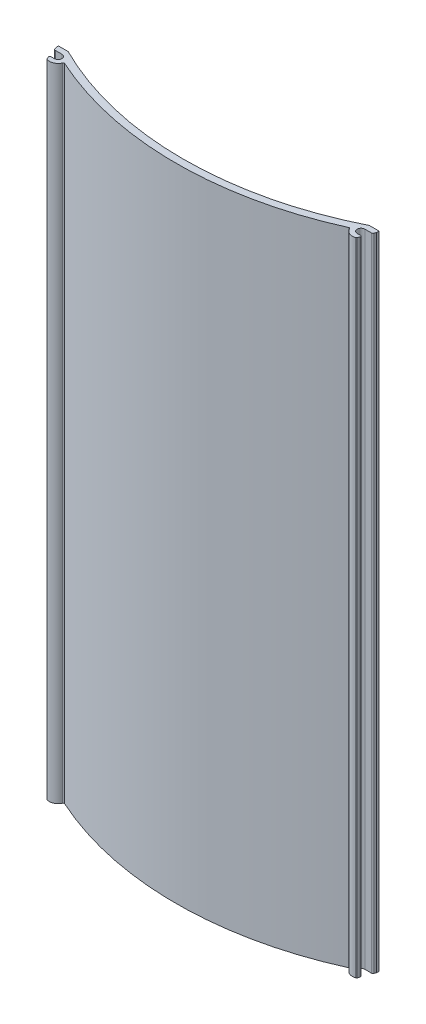
ISO-10303-21;
HEADER;
FILE_DESCRIPTION(('STEP AP214'),'2;1');
FILE_NAME('part.step','',(''),(''),'','','');
FILE_SCHEMA(('AUTOMOTIVE_DESIGN { 1 0 10303 214 1 1 1 1 }'));
ENDSEC;
DATA;
#1=APPLICATION_CONTEXT('core data for automotive mechanical design processes');
#2=APPLICATION_PROTOCOL_DEFINITION('international standard','automotive_design',2000,#1);
#3=PRODUCT_CONTEXT('',#1,'mechanical');
#4=PRODUCT('Part','Part','',(#3));
#5=PRODUCT_RELATED_PRODUCT_CATEGORY('part','',(#4));
#6=PRODUCT_DEFINITION_FORMATION('','',#4);
#7=PRODUCT_DEFINITION_CONTEXT('part definition',#1,'design');
#8=PRODUCT_DEFINITION('design','',#6,#7);
#9=PRODUCT_DEFINITION_SHAPE('','',#8);
#10=(LENGTH_UNIT() NAMED_UNIT(*) SI_UNIT(.MILLI.,.METRE.));
#11=(NAMED_UNIT(*) PLANE_ANGLE_UNIT() SI_UNIT($,.RADIAN.));
#12=(NAMED_UNIT(*) SI_UNIT($,.STERADIAN.) SOLID_ANGLE_UNIT());
#13=UNCERTAINTY_MEASURE_WITH_UNIT(LENGTH_MEASURE(1.E-05),#10,'distance_accuracy_value','');
#14=(GEOMETRIC_REPRESENTATION_CONTEXT(3) GLOBAL_UNCERTAINTY_ASSIGNED_CONTEXT((#13)) GLOBAL_UNIT_ASSIGNED_CONTEXT((#10,
#11,#12)) REPRESENTATION_CONTEXT('',''));
#15=CARTESIAN_POINT('',(0.,0.,0.));
#16=DIRECTION('',(0.,0.,1.));
#17=DIRECTION('',(1.,0.,0.));
#18=AXIS2_PLACEMENT_3D('',#15,#16,#17);
#19=CARTESIAN_POINT('',(101.58476,203.2,0.));
#20=DIRECTION('',(1.,0.,0.));
#21=DIRECTION('',(0.,0.,-1.));
#22=AXIS2_PLACEMENT_3D('',#19,#20,#21);
#23=PLANE('',#22);
#24=DIRECTION('',(0.,1.,0.));
#25=VECTOR('',#24,1.);
#26=CARTESIAN_POINT('',(101.58476,0.,-5.59206360851805));
#27=LINE('',#26,#25);
#28=CARTESIAN_POINT('',(101.58476,0.,-5.59206360851805));
#29=VERTEX_POINT('',#28);
#30=CARTESIAN_POINT('',(101.58476,203.2,-5.59206360851805));
#31=VERTEX_POINT('',#30);
#32=EDGE_CURVE('E351',#29,#31,#27,.T.);
#33=ORIENTED_EDGE('',*,*,#32,.F.);
#34=DIRECTION('',(0.,0.,1.));
#35=VECTOR('',#34,1.);
#36=CARTESIAN_POINT('',(101.58476,0.,0.));
#37=LINE('',#36,#35);
#38=CARTESIAN_POINT('',(101.58476,0.,-6.35406360851805));
#39=VERTEX_POINT('',#38);
#40=EDGE_CURVE('E354',#39,#29,#37,.T.);
#41=ORIENTED_EDGE('',*,*,#40,.F.);
#42=DIRECTION('',(0.,-1.,0.));
#43=VECTOR('',#42,1.);
#44=CARTESIAN_POINT('',(101.58476,203.2,-6.35406360851805));
#45=LINE('',#44,#43);
#46=CARTESIAN_POINT('',(101.58476,203.2,-6.35406360851805));
#47=VERTEX_POINT('',#46);
#48=EDGE_CURVE('E230',#47,#39,#45,.T.);
#49=ORIENTED_EDGE('',*,*,#48,.F.);
#50=DIRECTION('',(0.,0.,1.));
#51=VECTOR('',#50,1.);
#52=CARTESIAN_POINT('',(101.58476,203.2,0.));
#53=LINE('',#52,#51);
#54=EDGE_CURVE('E359',#47,#31,#53,.T.);
#55=ORIENTED_EDGE('',*,*,#54,.T.);
#56=EDGE_LOOP('',(#33,#41,#49,#55));
#57=FACE_BOUND('',#56,.T.);
#58=ADVANCED_FACE('F37',(#57),#23,.T.);
#59=CARTESIAN_POINT('',(0.,203.2,0.));
#60=DIRECTION('',(-1.,0.,0.));
#61=DIRECTION('',(0.,0.,1.));
#62=AXIS2_PLACEMENT_3D('',#59,#60,#61);
#63=PLANE('',#62);
#64=DIRECTION('',(0.,1.,0.));
#65=VECTOR('',#64,1.);
#66=CARTESIAN_POINT('',(0.,0.,-5.59206360851805));
#67=LINE('',#66,#65);
#68=CARTESIAN_POINT('',(0.,0.,-5.59206360851805));
#69=VERTEX_POINT('',#68);
#70=CARTESIAN_POINT('',(0.,203.2,-5.59206360851805));
#71=VERTEX_POINT('',#70);
#72=EDGE_CURVE('E355',#69,#71,#67,.T.);
#73=ORIENTED_EDGE('',*,*,#72,.T.);
#74=DIRECTION('',(0.,0.,-1.));
#75=VECTOR('',#74,1.);
#76=CARTESIAN_POINT('',(0.,203.2,0.));
#77=LINE('',#76,#75);
#78=CARTESIAN_POINT('',(0.,203.2,-6.35406360851805));
#79=VERTEX_POINT('',#78);
#80=EDGE_CURVE('E362',#71,#79,#77,.T.);
#81=ORIENTED_EDGE('',*,*,#80,.T.);
#82=DIRECTION('',(0.,-1.,0.));
#83=VECTOR('',#82,1.);
#84=CARTESIAN_POINT('',(0.,203.2,-6.35406360851805));
#85=LINE('',#84,#83);
#86=CARTESIAN_POINT('',(0.,0.,-6.35406360851805));
#87=VERTEX_POINT('',#86);
#88=EDGE_CURVE('E366',#79,#87,#85,.T.);
#89=ORIENTED_EDGE('',*,*,#88,.T.);
#90=DIRECTION('',(0.,0.,-1.));
#91=VECTOR('',#90,1.);
#92=CARTESIAN_POINT('',(0.,0.,0.));
#93=LINE('',#92,#91);
#94=EDGE_CURVE('E363',#69,#87,#93,.T.);
#95=ORIENTED_EDGE('',*,*,#94,.F.);
#96=EDGE_LOOP('',(#73,#81,#89,#95));
#97=FACE_BOUND('',#96,.T.);
#98=ADVANCED_FACE('F469',(#97),#63,.T.);
#99=CARTESIAN_POINT('',(0.,203.2,0.));
#100=DIRECTION('',(0.,1.,0.));
#101=DIRECTION('',(0.,0.,1.));
#102=AXIS2_PLACEMENT_3D('',#99,#100,#101);
#103=PLANE('',#102);
#104=CARTESIAN_POINT('',(50.79238,203.2,-101.753015943108));
#105=DIRECTION('',(0.,1.,0.));
#106=DIRECTION('',(0.,0.,1.));
#107=AXIS2_PLACEMENT_3D('',#104,#105,#106);
#108=CIRCLE('',#107,106.68);
#109=CARTESIAN_POINT('',(3.04657082827661,203.2,-6.35406360851807));
#110=VERTEX_POINT('',#109);
#111=CARTESIAN_POINT('',(98.5381891717234,203.2,-6.35406360851808));
#112=VERTEX_POINT('',#111);
#113=EDGE_CURVE('E234',#110,#112,#108,.T.);
#114=ORIENTED_EDGE('',*,*,#113,.F.);
#115=DIRECTION('',(-1.,0.,0.));
#116=VECTOR('',#115,1.);
#117=CARTESIAN_POINT('',(0.,203.2,-6.35406360851803));
#118=LINE('',#117,#116);
#119=EDGE_CURVE('E231',#110,#79,#118,.T.);
#120=ORIENTED_EDGE('',*,*,#119,.T.);
#121=ORIENTED_EDGE('',*,*,#80,.F.);
#122=DIRECTION('',(-0.342020143325663,0.,-0.939692620785911));
#123=VECTOR('',#122,1.);
#124=CARTESIAN_POINT('',(0.,203.2,-5.59206360851805));
#125=LINE('',#124,#123);
#126=CARTESIAN_POINT('',(0.225023227207039,203.2,-4.97381737291389));
#127=VERTEX_POINT('',#126);
#128=EDGE_CURVE('E315',#127,#71,#125,.T.);
#129=ORIENTED_EDGE('',*,*,#128,.F.);
#130=CARTESIAN_POINT('',(0.702387078566281,203.2,-5.14756360572333));
#131=DIRECTION('',(0.,1.,0.));
#132=DIRECTION('',(0.,0.,1.));
#133=AXIS2_PLACEMENT_3D('',#130,#131,#132);
#134=CIRCLE('',#133,0.508);
#135=CARTESIAN_POINT('',(0.702387078566281,203.2,-4.63956360572333));
#136=VERTEX_POINT('',#135);
#137=EDGE_CURVE('E379',#127,#136,#134,.T.);
#138=ORIENTED_EDGE('',*,*,#137,.T.);
#139=DIRECTION('',(1.,0.,0.));
#140=VECTOR('',#139,1.);
#141=CARTESIAN_POINT('',(0.,203.2,-4.63956360572333));
#142=LINE('',#141,#140);
#143=CARTESIAN_POINT('',(2.79400000000006,203.2,-4.63956360572333));
#144=VERTEX_POINT('',#143);
#145=EDGE_CURVE('E279',#136,#144,#142,.T.);
#146=ORIENTED_EDGE('',*,*,#145,.T.);
#147=CARTESIAN_POINT('',(2.79400000000006,203.2,-3.43306360572333));
#148=DIRECTION('',(0.,1.,0.));
#149=DIRECTION('',(0.,0.,1.));
#150=AXIS2_PLACEMENT_3D('',#147,#148,#149);
#151=CIRCLE('',#150,1.2065);
#152=CARTESIAN_POINT('',(2.79400000000006,203.2,-2.22656360572333));
#153=VERTEX_POINT('',#152);
#154=EDGE_CURVE('E221',#153,#144,#151,.T.);
#155=ORIENTED_EDGE('',*,*,#154,.F.);
#156=DIRECTION('',(-1.,0.,0.));
#157=VECTOR('',#156,1.);
#158=CARTESIAN_POINT('',(0.,203.2,-2.22656360572333));
#159=LINE('',#158,#157);
#160=CARTESIAN_POINT('',(1.76906621500891,203.2,-2.22656360572333));
#161=VERTEX_POINT('',#160);
#162=EDGE_CURVE('E264',#153,#161,#159,.T.);
#163=ORIENTED_EDGE('',*,*,#162,.T.);
#164=CARTESIAN_POINT('',(1.76906621500891,203.2,-1.84556360572333));
#165=DIRECTION('',(0.,1.,0.));
#166=DIRECTION('',(0.,0.,1.));
#167=AXIS2_PLACEMENT_3D('',#164,#165,#166);
#168=CIRCLE('',#167,0.380999999999997);
#169=CARTESIAN_POINT('',(1.41104332648949,203.2,-1.71525393111625));
#170=VERTEX_POINT('',#169);
#171=EDGE_CURVE('E267',#161,#170,#168,.T.);
#172=ORIENTED_EDGE('',*,*,#171,.T.);
#173=DIRECTION('',(0.342020143325688,0.,0.939692620785901));
#174=VECTOR('',#173,1.);
#175=CARTESIAN_POINT('',(1.79725460006727,203.2,-0.654147177822537));
#176=LINE('',#175,#174);
#177=CARTESIAN_POINT('',(1.63748848128624,203.2,-1.09310098156731));
#178=VERTEX_POINT('',#177);
#179=EDGE_CURVE('E270',#170,#178,#176,.T.);
#180=ORIENTED_EDGE('',*,*,#179,.T.);
#181=CARTESIAN_POINT('',(1.99551136980568,203.2,-1.2234106561744));
#182=DIRECTION('',(0.,1.,0.));
#183=DIRECTION('',(0.,0.,1.));
#184=AXIS2_PLACEMENT_3D('',#181,#182,#183);
#185=CIRCLE('',#184,0.381000000000005);
#186=CARTESIAN_POINT('',(1.86602672707145,203.2,-0.865088556247538));
#187=VERTEX_POINT('',#186);
#188=EDGE_CURVE('E273',#178,#187,#185,.T.);
#189=ORIENTED_EDGE('',*,*,#188,.T.);
#190=CARTESIAN_POINT('',(2.79400000000006,203.2,-3.43306360572333));
#191=DIRECTION('',(0.,1.,0.));
#192=DIRECTION('',(0.,0.,1.));
#193=AXIS2_PLACEMENT_3D('',#190,#191,#192);
#194=CIRCLE('',#193,2.7305);
#195=CARTESIAN_POINT('',(5.28772025470749,203.2,-2.32086329046446));
#196=VERTEX_POINT('',#195);
#197=EDGE_CURVE('E276',#187,#196,#194,.T.);
#198=ORIENTED_EDGE('',*,*,#197,.T.);
#199=CARTESIAN_POINT('',(5.63568122048062,203.2,-2.16567254880043));
#200=DIRECTION('',(0.,1.,0.));
#201=DIRECTION('',(0.,0.,1.));
#202=AXIS2_PLACEMENT_3D('',#199,#200,#201);
#203=CIRCLE('',#202,0.381);
#204=CARTESIAN_POINT('',(5.79302163434654,203.2,-2.51266677665517));
#205=VERTEX_POINT('',#204);
#206=EDGE_CURVE('E401',#196,#205,#203,.F.);
#207=ORIENTED_EDGE('',*,*,#206,.T.);
#208=CARTESIAN_POINT('',(50.79238,203.2,-101.753015943108));
#209=DIRECTION('',(0.,1.,0.));
#210=DIRECTION('',(0.,0.,1.));
#211=AXIS2_PLACEMENT_3D('',#208,#209,#210);
#212=CIRCLE('',#211,108.966);
#213=CARTESIAN_POINT('',(95.7917383656531,203.2,-2.512666776655));
#214=VERTEX_POINT('',#213);
#215=EDGE_CURVE('E237',#205,#214,#212,.T.);
#216=ORIENTED_EDGE('',*,*,#215,.T.);
#217=CARTESIAN_POINT('',(95.949078779519,203.2,-2.16567254880027));
#218=DIRECTION('',(0.,1.,0.));
#219=DIRECTION('',(0.,0.,1.));
#220=AXIS2_PLACEMENT_3D('',#217,#218,#219);
#221=CIRCLE('',#220,0.381);
#222=CARTESIAN_POINT('',(96.2970397452925,203.2,-2.32086329046445));
#223=VERTEX_POINT('',#222);
#224=EDGE_CURVE('E45',#214,#223,#221,.F.);
#225=ORIENTED_EDGE('',*,*,#224,.T.);
#226=CARTESIAN_POINT('',(98.7907599999999,203.2,-3.43306360572333));
#227=DIRECTION('',(0.,1.,0.));
#228=DIRECTION('',(0.,0.,1.));
#229=AXIS2_PLACEMENT_3D('',#226,#227,#228);
#230=CIRCLE('',#229,2.7305);
#231=CARTESIAN_POINT('',(99.7187332729286,203.2,-0.865088556247562));
#232=VERTEX_POINT('',#231);
#233=EDGE_CURVE('E334',#232,#223,#230,.F.);
#234=ORIENTED_EDGE('',*,*,#233,.F.);
#235=CARTESIAN_POINT('',(99.5892486301943,203.2,-1.2234106561744));
#236=DIRECTION('',(0.,1.,0.));
#237=DIRECTION('',(0.,0.,1.));
#238=AXIS2_PLACEMENT_3D('',#235,#236,#237);
#239=CIRCLE('',#238,0.38100000000002);
#240=CARTESIAN_POINT('',(99.9472715187138,203.2,-1.09310098156733));
#241=VERTEX_POINT('',#240);
#242=EDGE_CURVE('E294',#241,#232,#239,.F.);
#243=ORIENTED_EDGE('',*,*,#242,.F.);
#244=DIRECTION('',(-0.342020143325679,0.,0.939692620785905));
#245=VECTOR('',#244,1.);
#246=CARTESIAN_POINT('',(87.9043458517195,203.2,31.9945653526687));
#247=LINE('',#246,#245);
#248=CARTESIAN_POINT('',(100.173716673511,203.2,-1.71525393111625));
#249=VERTEX_POINT('',#248);
#250=EDGE_CURVE('E318',#249,#241,#247,.T.);
#251=ORIENTED_EDGE('',*,*,#250,.F.);
#252=CARTESIAN_POINT('',(99.8156937849911,203.2,-1.84556360572333));
#253=DIRECTION('',(0.,1.,0.));
#254=DIRECTION('',(0.,0.,1.));
#255=AXIS2_PLACEMENT_3D('',#252,#253,#254);
#256=CIRCLE('',#255,0.381000000000009);
#257=CARTESIAN_POINT('',(99.8156937849911,203.2,-2.22656360572333));
#258=VERTEX_POINT('',#257);
#259=EDGE_CURVE('E321',#258,#249,#256,.F.);
#260=ORIENTED_EDGE('',*,*,#259,.F.);
#261=DIRECTION('',(1.,0.,0.));
#262=VECTOR('',#261,1.);
#263=CARTESIAN_POINT('',(0.,203.2,-2.22656360572333));
#264=LINE('',#263,#262);
#265=CARTESIAN_POINT('',(98.7907599999999,203.2,-2.22656360572333));
#266=VERTEX_POINT('',#265);
#267=EDGE_CURVE('E324',#266,#258,#264,.T.);
#268=ORIENTED_EDGE('',*,*,#267,.F.);
#269=CARTESIAN_POINT('',(98.7907599999999,203.2,-3.43306360572333));
#270=DIRECTION('',(0.,1.,0.));
#271=DIRECTION('',(0.,0.,1.));
#272=AXIS2_PLACEMENT_3D('',#269,#270,#271);
#273=CIRCLE('',#272,1.2065);
#274=CARTESIAN_POINT('',(98.7907599999999,203.2,-4.63956360572333));
#275=VERTEX_POINT('',#274);
#276=EDGE_CURVE('E327',#266,#275,#273,.F.);
#277=ORIENTED_EDGE('',*,*,#276,.T.);
#278=DIRECTION('',(-1.,0.,0.));
#279=VECTOR('',#278,1.);
#280=CARTESIAN_POINT('',(0.,203.2,-4.63956360572329));
#281=LINE('',#280,#279);
#282=CARTESIAN_POINT('',(100.882372921434,203.2,-4.63956360572333));
#283=VERTEX_POINT('',#282);
#284=EDGE_CURVE('E330',#283,#275,#281,.T.);
#285=ORIENTED_EDGE('',*,*,#284,.F.);
#286=CARTESIAN_POINT('',(100.882372921434,203.2,-5.14756360572333));
#287=DIRECTION('',(0.,1.,0.));
#288=DIRECTION('',(0.,0.,1.));
#289=AXIS2_PLACEMENT_3D('',#286,#287,#288);
#290=CIRCLE('',#289,0.508);
#291=CARTESIAN_POINT('',(101.359736772793,203.2,-4.97381737291389));
#292=VERTEX_POINT('',#291);
#293=EDGE_CURVE('E377',#283,#292,#290,.T.);
#294=ORIENTED_EDGE('',*,*,#293,.T.);
#295=DIRECTION('',(0.342020143325674,0.,-0.939692620785907));
#296=VECTOR('',#295,1.);
#297=CARTESIAN_POINT('',(87.90434585172,203.2,31.9945653526683));
#298=LINE('',#297,#296);
#299=EDGE_CURVE('E332',#292,#31,#298,.T.);
#300=ORIENTED_EDGE('',*,*,#299,.T.);
#301=ORIENTED_EDGE('',*,*,#54,.F.);
#302=DIRECTION('',(-1.,0.,0.));
#303=VECTOR('',#302,1.);
#304=CARTESIAN_POINT('',(0.,203.2,-6.35406360851897));
#305=LINE('',#304,#303);
#306=EDGE_CURVE('E461',#47,#112,#305,.T.);
#307=ORIENTED_EDGE('',*,*,#306,.T.);
#308=EDGE_LOOP('',(#114,#120,#121,#129,#138,#146,#155,#163,#172,#180,#189,#198,#207,#216,#225,
#234,#243,#251,#260,#268,#277,#285,#294,#300,#301,#307));
#309=FACE_BOUND('',#308,.T.);
#310=ADVANCED_FACE('F417',(#309),#103,.T.);
#311=CARTESIAN_POINT('',(0.,0.,0.));
#312=DIRECTION('',(0.,1.,0.));
#313=DIRECTION('',(0.,0.,1.));
#314=AXIS2_PLACEMENT_3D('',#311,#312,#313);
#315=PLANE('',#314);
#316=DIRECTION('',(-1.,0.,0.));
#317=VECTOR('',#316,1.);
#318=CARTESIAN_POINT('',(0.,0.,-6.35406360851803));
#319=LINE('',#318,#317);
#320=CARTESIAN_POINT('',(3.04657082827661,0.,-6.35406360851807));
#321=VERTEX_POINT('',#320);
#322=EDGE_CURVE('E216',#321,#87,#319,.T.);
#323=ORIENTED_EDGE('',*,*,#322,.F.);
#324=CARTESIAN_POINT('',(50.79238,0.,-101.753015943108));
#325=DIRECTION('',(0.,1.,0.));
#326=DIRECTION('',(0.,0.,1.));
#327=AXIS2_PLACEMENT_3D('',#324,#325,#326);
#328=CIRCLE('',#327,106.68);
#329=CARTESIAN_POINT('',(98.5381891717234,0.,-6.35406360851808));
#330=VERTEX_POINT('',#329);
#331=EDGE_CURVE('E209',#321,#330,#328,.T.);
#332=ORIENTED_EDGE('',*,*,#331,.T.);
#333=DIRECTION('',(-1.,0.,0.));
#334=VECTOR('',#333,1.);
#335=CARTESIAN_POINT('',(0.,0.,-6.35406360851897));
#336=LINE('',#335,#334);
#337=EDGE_CURVE('E213',#39,#330,#336,.T.);
#338=ORIENTED_EDGE('',*,*,#337,.F.);
#339=ORIENTED_EDGE('',*,*,#40,.T.);
#340=DIRECTION('',(-0.342020143325674,0.,0.939692620785907));
#341=VECTOR('',#340,1.);
#342=CARTESIAN_POINT('',(87.90434585172,0.,31.9945653526683));
#343=LINE('',#342,#341);
#344=CARTESIAN_POINT('',(101.359736772793,0.,-4.97381737291389));
#345=VERTEX_POINT('',#344);
#346=EDGE_CURVE('E307',#29,#345,#343,.T.);
#347=ORIENTED_EDGE('',*,*,#346,.T.);
#348=CARTESIAN_POINT('',(100.882372921434,0.,-5.14756360572333));
#349=DIRECTION('',(0.,1.,0.));
#350=DIRECTION('',(0.,0.,1.));
#351=AXIS2_PLACEMENT_3D('',#348,#349,#350);
#352=CIRCLE('',#351,0.508);
#353=CARTESIAN_POINT('',(100.882372921434,0.,-4.63956360572333));
#354=VERTEX_POINT('',#353);
#355=EDGE_CURVE('E383',#345,#354,#352,.F.);
#356=ORIENTED_EDGE('',*,*,#355,.T.);
#357=DIRECTION('',(1.,0.,0.));
#358=VECTOR('',#357,1.);
#359=CARTESIAN_POINT('',(0.,0.,-4.63956360572329));
#360=LINE('',#359,#358);
#361=CARTESIAN_POINT('',(98.7907599999999,0.,-4.63956360572333));
#362=VERTEX_POINT('',#361);
#363=EDGE_CURVE('E304',#362,#354,#360,.T.);
#364=ORIENTED_EDGE('',*,*,#363,.F.);
#365=CARTESIAN_POINT('',(98.7907599999999,0.,-3.43306360572333));
#366=DIRECTION('',(0.,1.,0.));
#367=DIRECTION('',(0.,0.,1.));
#368=AXIS2_PLACEMENT_3D('',#365,#366,#367);
#369=CIRCLE('',#368,1.2065);
#370=CARTESIAN_POINT('',(98.7907599999999,0.,-2.22656360572333));
#371=VERTEX_POINT('',#370);
#372=EDGE_CURVE('E302',#362,#371,#369,.T.);
#373=ORIENTED_EDGE('',*,*,#372,.T.);
#374=DIRECTION('',(-1.,0.,0.));
#375=VECTOR('',#374,1.);
#376=CARTESIAN_POINT('',(0.,0.,-2.22656360572333));
#377=LINE('',#376,#375);
#378=CARTESIAN_POINT('',(99.8156937849911,0.,-2.22656360572334));
#379=VERTEX_POINT('',#378);
#380=EDGE_CURVE('E298',#379,#371,#377,.T.);
#381=ORIENTED_EDGE('',*,*,#380,.F.);
#382=CARTESIAN_POINT('',(99.8156937849911,0.,-1.84556360572333));
#383=DIRECTION('',(0.,1.,0.));
#384=DIRECTION('',(0.,0.,1.));
#385=AXIS2_PLACEMENT_3D('',#382,#383,#384);
#386=CIRCLE('',#385,0.381000000000009);
#387=CARTESIAN_POINT('',(100.173716673511,0.,-1.71525393111625));
#388=VERTEX_POINT('',#387);
#389=EDGE_CURVE('E295',#388,#379,#386,.T.);
#390=ORIENTED_EDGE('',*,*,#389,.F.);
#391=DIRECTION('',(0.342020143325679,0.,-0.939692620785905));
#392=VECTOR('',#391,1.);
#393=CARTESIAN_POINT('',(87.9043458517195,0.,31.9945653526687));
#394=LINE('',#393,#392);
#395=CARTESIAN_POINT('',(99.9472715187138,0.,-1.09310098156733));
#396=VERTEX_POINT('',#395);
#397=EDGE_CURVE('E299',#396,#388,#394,.T.);
#398=ORIENTED_EDGE('',*,*,#397,.F.);
#399=CARTESIAN_POINT('',(99.5892486301943,0.,-1.2234106561744));
#400=DIRECTION('',(0.,1.,0.));
#401=DIRECTION('',(0.,0.,1.));
#402=AXIS2_PLACEMENT_3D('',#399,#400,#401);
#403=CIRCLE('',#402,0.38100000000002);
#404=CARTESIAN_POINT('',(99.7187332729286,0.,-0.865088556247562));
#405=VERTEX_POINT('',#404);
#406=EDGE_CURVE('E312',#405,#396,#403,.T.);
#407=ORIENTED_EDGE('',*,*,#406,.F.);
#408=CARTESIAN_POINT('',(98.7907599999999,0.,-3.43306360572333));
#409=DIRECTION('',(0.,1.,0.));
#410=DIRECTION('',(0.,0.,1.));
#411=AXIS2_PLACEMENT_3D('',#408,#409,#410);
#412=CIRCLE('',#411,2.7305);
#413=CARTESIAN_POINT('',(96.2970397452925,0.,-2.32086329046445));
#414=VERTEX_POINT('',#413);
#415=EDGE_CURVE('E310',#414,#405,#412,.T.);
#416=ORIENTED_EDGE('',*,*,#415,.F.);
#417=CARTESIAN_POINT('',(95.949078779519,0.,-2.16567254880027));
#418=DIRECTION('',(0.,1.,0.));
#419=DIRECTION('',(0.,0.,1.));
#420=AXIS2_PLACEMENT_3D('',#417,#418,#419);
#421=CIRCLE('',#420,0.381);
#422=CARTESIAN_POINT('',(95.7917383656531,0.,-2.512666776655));
#423=VERTEX_POINT('',#422);
#424=EDGE_CURVE('E11',#414,#423,#421,.T.);
#425=ORIENTED_EDGE('',*,*,#424,.T.);
#426=CARTESIAN_POINT('',(50.79238,0.,-101.753015943108));
#427=DIRECTION('',(0.,1.,0.));
#428=DIRECTION('',(0.,0.,1.));
#429=AXIS2_PLACEMENT_3D('',#426,#427,#428);
#430=CIRCLE('',#429,108.966);
#431=CARTESIAN_POINT('',(5.79302163434654,0.,-2.51266677665517));
#432=VERTEX_POINT('',#431);
#433=EDGE_CURVE('E222',#432,#423,#430,.T.);
#434=ORIENTED_EDGE('',*,*,#433,.F.);
#435=CARTESIAN_POINT('',(5.63568122048062,0.,-2.16567254880043));
#436=DIRECTION('',(0.,1.,0.));
#437=DIRECTION('',(0.,0.,1.));
#438=AXIS2_PLACEMENT_3D('',#435,#436,#437);
#439=CIRCLE('',#438,0.381);
#440=CARTESIAN_POINT('',(5.28772025470749,0.,-2.32086329046446));
#441=VERTEX_POINT('',#440);
#442=EDGE_CURVE('E403',#432,#441,#439,.T.);
#443=ORIENTED_EDGE('',*,*,#442,.T.);
#444=CARTESIAN_POINT('',(2.79400000000006,0.,-3.43306360572333));
#445=DIRECTION('',(0.,1.,0.));
#446=DIRECTION('',(0.,0.,1.));
#447=AXIS2_PLACEMENT_3D('',#444,#445,#446);
#448=CIRCLE('',#447,2.7305);
#449=CARTESIAN_POINT('',(1.86602672707145,0.,-0.865088556247538));
#450=VERTEX_POINT('',#449);
#451=EDGE_CURVE('E253',#441,#450,#448,.F.);
#452=ORIENTED_EDGE('',*,*,#451,.T.);
#453=CARTESIAN_POINT('',(1.99551136980568,0.,-1.2234106561744));
#454=DIRECTION('',(0.,1.,0.));
#455=DIRECTION('',(0.,0.,1.));
#456=AXIS2_PLACEMENT_3D('',#453,#454,#455);
#457=CIRCLE('',#456,0.381000000000005);
#458=CARTESIAN_POINT('',(1.63748848128624,0.,-1.09310098156731));
#459=VERTEX_POINT('',#458);
#460=EDGE_CURVE('E251',#450,#459,#457,.F.);
#461=ORIENTED_EDGE('',*,*,#460,.T.);
#462=DIRECTION('',(-0.342020143325688,0.,-0.939692620785901));
#463=VECTOR('',#462,1.);
#464=CARTESIAN_POINT('',(1.79725460006727,0.,-0.654147177822537));
#465=LINE('',#464,#463);
#466=CARTESIAN_POINT('',(1.41104332648949,0.,-1.71525393111625));
#467=VERTEX_POINT('',#466);
#468=EDGE_CURVE('E248',#459,#467,#465,.T.);
#469=ORIENTED_EDGE('',*,*,#468,.T.);
#470=CARTESIAN_POINT('',(1.76906621500891,0.,-1.84556360572333));
#471=DIRECTION('',(0.,1.,0.));
#472=DIRECTION('',(0.,0.,1.));
#473=AXIS2_PLACEMENT_3D('',#470,#471,#472);
#474=CIRCLE('',#473,0.380999999999997);
#475=CARTESIAN_POINT('',(1.76906621500891,0.,-2.22656360572333));
#476=VERTEX_POINT('',#475);
#477=EDGE_CURVE('E246',#467,#476,#474,.F.);
#478=ORIENTED_EDGE('',*,*,#477,.T.);
#479=DIRECTION('',(1.,0.,0.));
#480=VECTOR('',#479,1.);
#481=CARTESIAN_POINT('',(0.,0.,-2.22656360572333));
#482=LINE('',#481,#480);
#483=CARTESIAN_POINT('',(2.79400000000006,0.,-2.22656360572333));
#484=VERTEX_POINT('',#483);
#485=EDGE_CURVE('E261',#476,#484,#482,.T.);
#486=ORIENTED_EDGE('',*,*,#485,.T.);
#487=CARTESIAN_POINT('',(2.79400000000006,0.,-3.43306360572333));
#488=DIRECTION('',(0.,1.,0.));
#489=DIRECTION('',(0.,0.,1.));
#490=AXIS2_PLACEMENT_3D('',#487,#488,#489);
#491=CIRCLE('',#490,1.2065);
#492=CARTESIAN_POINT('',(2.79400000000006,0.,-4.63956360572333));
#493=VERTEX_POINT('',#492);
#494=EDGE_CURVE('E258',#493,#484,#491,.F.);
#495=ORIENTED_EDGE('',*,*,#494,.F.);
#496=DIRECTION('',(-1.,0.,0.));
#497=VECTOR('',#496,1.);
#498=CARTESIAN_POINT('',(0.,0.,-4.63956360572333));
#499=LINE('',#498,#497);
#500=CARTESIAN_POINT('',(0.702387078566281,0.,-4.63956360572333));
#501=VERTEX_POINT('',#500);
#502=EDGE_CURVE('E255',#493,#501,#499,.T.);
#503=ORIENTED_EDGE('',*,*,#502,.T.);
#504=CARTESIAN_POINT('',(0.702387078566281,0.,-5.14756360572333));
#505=DIRECTION('',(0.,1.,0.));
#506=DIRECTION('',(0.,0.,1.));
#507=AXIS2_PLACEMENT_3D('',#504,#505,#506);
#508=CIRCLE('',#507,0.508);
#509=CARTESIAN_POINT('',(0.225023227207038,0.,-4.97381737291389));
#510=VERTEX_POINT('',#509);
#511=EDGE_CURVE('E385',#501,#510,#508,.F.);
#512=ORIENTED_EDGE('',*,*,#511,.T.);
#513=DIRECTION('',(-0.342020143325663,0.,-0.939692620785911));
#514=VECTOR('',#513,1.);
#515=CARTESIAN_POINT('',(1.79725460006717,0.,-0.654147177822447));
#516=LINE('',#515,#514);
#517=EDGE_CURVE('E372',#510,#69,#516,.T.);
#518=ORIENTED_EDGE('',*,*,#517,.T.);
#519=ORIENTED_EDGE('',*,*,#94,.T.);
#520=EDGE_LOOP('',(#323,#332,#338,#339,#347,#356,#364,#373,#381,#390,#398,#407,#416,#425,#434,
#443,#452,#461,#469,#478,#486,#495,#503,#512,#518,#519));
#521=FACE_BOUND('',#520,.T.);
#522=ADVANCED_FACE('F211',(#521),#315,.F.);
#523=CARTESIAN_POINT('',(0.,0.,-5.59206360851805));
#524=DIRECTION('',(0.93969262078591,0.,-0.342020143325663));
#525=DIRECTION('',(-0.342020143325663,0.,-0.939692620785911));
#526=AXIS2_PLACEMENT_3D('',#523,#524,#525);
#527=PLANE('',#526);
#528=ORIENTED_EDGE('',*,*,#517,.F.);
#529=DIRECTION('',(0.,1.,0.));
#530=VECTOR('',#529,1.);
#531=CARTESIAN_POINT('',(0.225023227207039,203.2,-4.97381737291389));
#532=LINE('',#531,#530);
#533=EDGE_CURVE('E374',#510,#127,#532,.T.);
#534=ORIENTED_EDGE('',*,*,#533,.T.);
#535=ORIENTED_EDGE('',*,*,#128,.T.);
#536=ORIENTED_EDGE('',*,*,#72,.F.);
#537=EDGE_LOOP('',(#528,#534,#535,#536));
#538=FACE_BOUND('',#537,.T.);
#539=ADVANCED_FACE('F474',(#538),#527,.F.);
#540=CARTESIAN_POINT('',(87.9043458517195,-7.7654131109568,31.9945653526687));
#541=DIRECTION('',(-0.939692620785905,0.,-0.342020143325679));
#542=DIRECTION('',(-0.342020143325679,0.,0.939692620785905));
#543=AXIS2_PLACEMENT_3D('',#540,#541,#542);
#544=PLANE('',#543);
#545=DIRECTION('',(0.,1.,0.));
#546=VECTOR('',#545,1.);
#547=CARTESIAN_POINT('',(99.9472715187138,-7.7654131109568,-1.09310098156733));
#548=LINE('',#547,#546);
#549=EDGE_CURVE('E336',#396,#241,#548,.T.);
#550=ORIENTED_EDGE('',*,*,#549,.F.);
#551=ORIENTED_EDGE('',*,*,#397,.T.);
#552=DIRECTION('',(0.,1.,0.));
#553=VECTOR('',#552,1.);
#554=CARTESIAN_POINT('',(100.173716673511,-7.7654131109568,-1.71525393111625));
#555=LINE('',#554,#553);
#556=EDGE_CURVE('E346',#388,#249,#555,.T.);
#557=ORIENTED_EDGE('',*,*,#556,.T.);
#558=ORIENTED_EDGE('',*,*,#250,.T.);
#559=EDGE_LOOP('',(#550,#551,#557,#558));
#560=FACE_BOUND('',#559,.T.);
#561=ADVANCED_FACE('F432',(#560),#544,.F.);
#562=CARTESIAN_POINT('',(99.8156937849911,-7.7654131109568,-1.84556360572333));
#563=DIRECTION('',(0.,1.,0.));
#564=DIRECTION('',(0.,0.,1.));
#565=AXIS2_PLACEMENT_3D('',#562,#563,#564);
#566=CYLINDRICAL_SURFACE('',#565,0.381000000000009);
#567=ORIENTED_EDGE('',*,*,#556,.F.);
#568=ORIENTED_EDGE('',*,*,#389,.T.);
#569=DIRECTION('',(0.,1.,0.));
#570=VECTOR('',#569,1.);
#571=CARTESIAN_POINT('',(99.8156937849911,-7.7654131109568,-2.22656360572333));
#572=LINE('',#571,#570);
#573=EDGE_CURVE('E344',#379,#258,#572,.T.);
#574=ORIENTED_EDGE('',*,*,#573,.T.);
#575=ORIENTED_EDGE('',*,*,#259,.T.);
#576=EDGE_LOOP('',(#567,#568,#574,#575));
#577=FACE_BOUND('',#576,.T.);
#578=ADVANCED_FACE('F438',(#577),#566,.T.);
#579=CARTESIAN_POINT('',(0.,-7.7654131109568,-2.22656360572333));
#580=DIRECTION('',(0.,0.,1.));
#581=DIRECTION('',(1.,0.,0.));
#582=AXIS2_PLACEMENT_3D('',#579,#580,#581);
#583=PLANE('',#582);
#584=ORIENTED_EDGE('',*,*,#573,.F.);
#585=ORIENTED_EDGE('',*,*,#380,.T.);
#586=DIRECTION('',(0.,1.,0.));
#587=VECTOR('',#586,1.);
#588=CARTESIAN_POINT('',(98.7907599999999,-7.7654131109568,-2.22656360572333));
#589=LINE('',#588,#587);
#590=EDGE_CURVE('E342',#371,#266,#589,.T.);
#591=ORIENTED_EDGE('',*,*,#590,.T.);
#592=ORIENTED_EDGE('',*,*,#267,.T.);
#593=EDGE_LOOP('',(#584,#585,#591,#592));
#594=FACE_BOUND('',#593,.T.);
#595=ADVANCED_FACE('F441',(#594),#583,.F.);
#596=CARTESIAN_POINT('',(98.7907599999999,-7.7654131109568,-3.43306360572333));
#597=DIRECTION('',(0.,1.,0.));
#598=DIRECTION('',(0.,0.,1.));
#599=AXIS2_PLACEMENT_3D('',#596,#597,#598);
#600=CYLINDRICAL_SURFACE('',#599,1.2065);
#601=ORIENTED_EDGE('',*,*,#372,.F.);
#602=DIRECTION('',(0.,1.,0.));
#603=VECTOR('',#602,1.);
#604=CARTESIAN_POINT('',(98.7907599999999,-7.7654131109568,-4.63956360572333));
#605=LINE('',#604,#603);
#606=EDGE_CURVE('E339',#362,#275,#605,.T.);
#607=ORIENTED_EDGE('',*,*,#606,.T.);
#608=ORIENTED_EDGE('',*,*,#276,.F.);
#609=ORIENTED_EDGE('',*,*,#590,.F.);
#610=EDGE_LOOP('',(#601,#607,#608,#609));
#611=FACE_BOUND('',#610,.T.);
#612=ADVANCED_FACE('F445',(#611),#600,.F.);
#613=CARTESIAN_POINT('',(0.,-7.7654131109568,-4.63956360572329));
#614=DIRECTION('',(0.,0.,-1.));
#615=DIRECTION('',(-1.,0.,0.));
#616=AXIS2_PLACEMENT_3D('',#613,#614,#615);
#617=PLANE('',#616);
#618=ORIENTED_EDGE('',*,*,#363,.T.);
#619=DIRECTION('',(0.,1.,0.));
#620=VECTOR('',#619,1.);
#621=CARTESIAN_POINT('',(100.882372921434,203.2,-4.63956360572333));
#622=LINE('',#621,#620);
#623=EDGE_CURVE('E387',#354,#283,#622,.T.);
#624=ORIENTED_EDGE('',*,*,#623,.T.);
#625=ORIENTED_EDGE('',*,*,#284,.T.);
#626=ORIENTED_EDGE('',*,*,#606,.F.);
#627=EDGE_LOOP('',(#618,#624,#625,#626));
#628=FACE_BOUND('',#627,.T.);
#629=ADVANCED_FACE('F450',(#628),#617,.F.);
#630=CARTESIAN_POINT('',(87.90434585172,-7.7654131109568,31.9945653526683));
#631=DIRECTION('',(0.939692620785907,0.,0.342020143325674));
#632=DIRECTION('',(0.342020143325674,0.,-0.939692620785907));
#633=AXIS2_PLACEMENT_3D('',#630,#631,#632);
#634=PLANE('',#633);
#635=ORIENTED_EDGE('',*,*,#299,.F.);
#636=DIRECTION('',(0.,1.,0.));
#637=VECTOR('',#636,1.);
#638=CARTESIAN_POINT('',(101.359736772793,0.,-4.97381737291388));
#639=LINE('',#638,#637);
#640=EDGE_CURVE('E390',#292,#345,#639,.F.);
#641=ORIENTED_EDGE('',*,*,#640,.T.);
#642=ORIENTED_EDGE('',*,*,#346,.F.);
#643=ORIENTED_EDGE('',*,*,#32,.T.);
#644=EDGE_LOOP('',(#635,#641,#642,#643));
#645=FACE_BOUND('',#644,.T.);
#646=ADVANCED_FACE('F457',(#645),#634,.T.);
#647=CARTESIAN_POINT('',(98.7907599999999,-7.7654131109568,-3.43306360572333));
#648=DIRECTION('',(0.,1.,0.));
#649=DIRECTION('',(0.,0.,1.));
#650=AXIS2_PLACEMENT_3D('',#647,#648,#649);
#651=CYLINDRICAL_SURFACE('',#650,2.7305);
#652=ORIENTED_EDGE('',*,*,#233,.T.);
#653=DIRECTION('',(0.,1.,0.));
#654=VECTOR('',#653,1.);
#655=CARTESIAN_POINT('',(96.2970397452925,-7.7654131109568,-2.32086329046445));
#656=LINE('',#655,#654);
#657=EDGE_CURVE('E52',#223,#414,#656,.F.);
#658=ORIENTED_EDGE('',*,*,#657,.T.);
#659=ORIENTED_EDGE('',*,*,#415,.T.);
#660=DIRECTION('',(0.,1.,0.));
#661=VECTOR('',#660,1.);
#662=CARTESIAN_POINT('',(99.7187332729286,-7.7654131109568,-0.865088556247562));
#663=LINE('',#662,#661);
#664=EDGE_CURVE('E337',#405,#232,#663,.T.);
#665=ORIENTED_EDGE('',*,*,#664,.T.);
#666=EDGE_LOOP('',(#652,#658,#659,#665));
#667=FACE_BOUND('',#666,.T.);
#668=ADVANCED_FACE('F425',(#667),#651,.T.);
#669=CARTESIAN_POINT('',(99.5892486301943,-7.7654131109568,-1.2234106561744));
#670=DIRECTION('',(0.,1.,0.));
#671=DIRECTION('',(0.,0.,1.));
#672=AXIS2_PLACEMENT_3D('',#669,#670,#671);
#673=CYLINDRICAL_SURFACE('',#672,0.38100000000002);
#674=ORIENTED_EDGE('',*,*,#664,.F.);
#675=ORIENTED_EDGE('',*,*,#406,.T.);
#676=ORIENTED_EDGE('',*,*,#549,.T.);
#677=ORIENTED_EDGE('',*,*,#242,.T.);
#678=EDGE_LOOP('',(#674,#675,#676,#677));
#679=FACE_BOUND('',#678,.T.);
#680=ADVANCED_FACE('F429',(#679),#673,.T.);
#681=CARTESIAN_POINT('',(2.79400000000006,-7.7654131109568,-3.43306360572333));
#682=DIRECTION('',(0.,1.,0.));
#683=DIRECTION('',(0.,0.,1.));
#684=AXIS2_PLACEMENT_3D('',#681,#682,#683);
#685=CYLINDRICAL_SURFACE('',#684,1.2065);
#686=DIRECTION('',(0.,1.,0.));
#687=VECTOR('',#686,1.);
#688=CARTESIAN_POINT('',(2.79400000000006,-7.7654131109568,-4.63956360572333));
#689=LINE('',#688,#687);
#690=EDGE_CURVE('E249',#493,#144,#689,.T.);
#691=ORIENTED_EDGE('',*,*,#690,.F.);
#692=ORIENTED_EDGE('',*,*,#494,.T.);
#693=DIRECTION('',(0.,1.,0.));
#694=VECTOR('',#693,1.);
#695=CARTESIAN_POINT('',(2.79400000000006,-7.7654131109568,-2.22656360572333));
#696=LINE('',#695,#694);
#697=EDGE_CURVE('E281',#484,#153,#696,.T.);
#698=ORIENTED_EDGE('',*,*,#697,.T.);
#699=ORIENTED_EDGE('',*,*,#154,.T.);
#700=EDGE_LOOP('',(#691,#692,#698,#699));
#701=FACE_BOUND('',#700,.T.);
#702=ADVANCED_FACE('F487',(#701),#685,.F.);
#703=CARTESIAN_POINT('',(0.,-7.7654131109568,-4.63956360572333));
#704=DIRECTION('',(0.,0.,1.));
#705=DIRECTION('',(1.,0.,0.));
#706=AXIS2_PLACEMENT_3D('',#703,#704,#705);
#707=PLANE('',#706);
#708=ORIENTED_EDGE('',*,*,#145,.F.);
#709=DIRECTION('',(0.,1.,0.));
#710=VECTOR('',#709,1.);
#711=CARTESIAN_POINT('',(0.702387078566281,0.,-4.63956360572333));
#712=LINE('',#711,#710);
#713=EDGE_CURVE('E381',#136,#501,#712,.F.);
#714=ORIENTED_EDGE('',*,*,#713,.T.);
#715=ORIENTED_EDGE('',*,*,#502,.F.);
#716=ORIENTED_EDGE('',*,*,#690,.T.);
#717=EDGE_LOOP('',(#708,#714,#715,#716));
#718=FACE_BOUND('',#717,.T.);
#719=ADVANCED_FACE('F481',(#718),#707,.T.);
#720=CARTESIAN_POINT('',(2.79400000000006,-7.7654131109568,-3.43306360572333));
#721=DIRECTION('',(0.,1.,0.));
#722=DIRECTION('',(0.,0.,1.));
#723=AXIS2_PLACEMENT_3D('',#720,#721,#722);
#724=CYLINDRICAL_SURFACE('',#723,2.7305);
#725=ORIENTED_EDGE('',*,*,#451,.F.);
#726=DIRECTION('',(0.,1.,0.));
#727=VECTOR('',#726,1.);
#728=CARTESIAN_POINT('',(5.28772025470749,-7.7654131109568,-2.32086329046446));
#729=LINE('',#728,#727);
#730=EDGE_CURVE('E392',#441,#196,#729,.T.);
#731=ORIENTED_EDGE('',*,*,#730,.T.);
#732=ORIENTED_EDGE('',*,*,#197,.F.);
#733=DIRECTION('',(0.,1.,0.));
#734=VECTOR('',#733,1.);
#735=CARTESIAN_POINT('',(1.86602672707145,-7.7654131109568,-0.865088556247538));
#736=LINE('',#735,#734);
#737=EDGE_CURVE('E284',#450,#187,#736,.T.);
#738=ORIENTED_EDGE('',*,*,#737,.F.);
#739=EDGE_LOOP('',(#725,#731,#732,#738));
#740=FACE_BOUND('',#739,.T.);
#741=ADVANCED_FACE('F413',(#740),#724,.T.);
#742=CARTESIAN_POINT('',(1.99551136980568,-7.7654131109568,-1.2234106561744));
#743=DIRECTION('',(0.,1.,0.));
#744=DIRECTION('',(0.,0.,1.));
#745=AXIS2_PLACEMENT_3D('',#742,#743,#744);
#746=CYLINDRICAL_SURFACE('',#745,0.381000000000005);
#747=ORIENTED_EDGE('',*,*,#460,.F.);
#748=ORIENTED_EDGE('',*,*,#737,.T.);
#749=ORIENTED_EDGE('',*,*,#188,.F.);
#750=DIRECTION('',(0.,1.,0.));
#751=VECTOR('',#750,1.);
#752=CARTESIAN_POINT('',(1.63748848128624,-7.7654131109568,-1.09310098156731));
#753=LINE('',#752,#751);
#754=EDGE_CURVE('E286',#459,#178,#753,.T.);
#755=ORIENTED_EDGE('',*,*,#754,.F.);
#756=EDGE_LOOP('',(#747,#748,#749,#755));
#757=FACE_BOUND('',#756,.T.);
#758=ADVANCED_FACE('F506',(#757),#746,.T.);
#759=CARTESIAN_POINT('',(1.79725460006727,-7.7654131109568,-0.654147177822537));
#760=DIRECTION('',(-0.939692620785901,0.,0.342020143325688));
#761=DIRECTION('',(0.342020143325688,0.,0.939692620785901));
#762=AXIS2_PLACEMENT_3D('',#759,#760,#761);
#763=PLANE('',#762);
#764=ORIENTED_EDGE('',*,*,#468,.F.);
#765=ORIENTED_EDGE('',*,*,#754,.T.);
#766=ORIENTED_EDGE('',*,*,#179,.F.);
#767=DIRECTION('',(0.,1.,0.));
#768=VECTOR('',#767,1.);
#769=CARTESIAN_POINT('',(1.41104332648949,-7.7654131109568,-1.71525393111625));
#770=LINE('',#769,#768);
#771=EDGE_CURVE('E288',#467,#170,#770,.T.);
#772=ORIENTED_EDGE('',*,*,#771,.F.);
#773=EDGE_LOOP('',(#764,#765,#766,#772));
#774=FACE_BOUND('',#773,.T.);
#775=ADVANCED_FACE('F503',(#774),#763,.T.);
#776=CARTESIAN_POINT('',(1.76906621500891,-7.7654131109568,-1.84556360572333));
#777=DIRECTION('',(0.,1.,0.));
#778=DIRECTION('',(0.,0.,1.));
#779=AXIS2_PLACEMENT_3D('',#776,#777,#778);
#780=CYLINDRICAL_SURFACE('',#779,0.380999999999997);
#781=ORIENTED_EDGE('',*,*,#477,.F.);
#782=ORIENTED_EDGE('',*,*,#771,.T.);
#783=ORIENTED_EDGE('',*,*,#171,.F.);
#784=DIRECTION('',(0.,1.,0.));
#785=VECTOR('',#784,1.);
#786=CARTESIAN_POINT('',(1.76906621500891,-7.7654131109568,-2.22656360572333));
#787=LINE('',#786,#785);
#788=EDGE_CURVE('E290',#476,#161,#787,.T.);
#789=ORIENTED_EDGE('',*,*,#788,.F.);
#790=EDGE_LOOP('',(#781,#782,#783,#789));
#791=FACE_BOUND('',#790,.T.);
#792=ADVANCED_FACE('F497',(#791),#780,.T.);
#793=CARTESIAN_POINT('',(0.,-7.7654131109568,-2.22656360572333));
#794=DIRECTION('',(0.,0.,-1.));
#795=DIRECTION('',(-1.,0.,0.));
#796=AXIS2_PLACEMENT_3D('',#793,#794,#795);
#797=PLANE('',#796);
#798=ORIENTED_EDGE('',*,*,#485,.F.);
#799=ORIENTED_EDGE('',*,*,#788,.T.);
#800=ORIENTED_EDGE('',*,*,#162,.F.);
#801=ORIENTED_EDGE('',*,*,#697,.F.);
#802=EDGE_LOOP('',(#798,#799,#800,#801));
#803=FACE_BOUND('',#802,.T.);
#804=ADVANCED_FACE('F492',(#803),#797,.T.);
#805=CARTESIAN_POINT('',(0.702387078566281,0.,-5.14756360572333));
#806=DIRECTION('',(0.,-1.,0.));
#807=DIRECTION('',(0.,0.,-1.));
#808=AXIS2_PLACEMENT_3D('',#805,#806,#807);
#809=CYLINDRICAL_SURFACE('',#808,0.508);
#810=ORIENTED_EDGE('',*,*,#511,.F.);
#811=ORIENTED_EDGE('',*,*,#713,.F.);
#812=ORIENTED_EDGE('',*,*,#137,.F.);
#813=ORIENTED_EDGE('',*,*,#533,.F.);
#814=EDGE_LOOP('',(#810,#811,#812,#813));
#815=FACE_BOUND('',#814,.T.);
#816=ADVANCED_FACE('F485',(#815),#809,.T.);
#817=CARTESIAN_POINT('',(100.882372921434,-7.7654131109568,-5.14756360572333));
#818=DIRECTION('',(0.,-1.,0.));
#819=DIRECTION('',(0.,0.,-1.));
#820=AXIS2_PLACEMENT_3D('',#817,#818,#819);
#821=CYLINDRICAL_SURFACE('',#820,0.508);
#822=ORIENTED_EDGE('',*,*,#355,.F.);
#823=ORIENTED_EDGE('',*,*,#640,.F.);
#824=ORIENTED_EDGE('',*,*,#293,.F.);
#825=ORIENTED_EDGE('',*,*,#623,.F.);
#826=EDGE_LOOP('',(#822,#823,#824,#825));
#827=FACE_BOUND('',#826,.T.);
#828=ADVANCED_FACE('F454',(#827),#821,.T.);
#829=CARTESIAN_POINT('',(50.79238,0.,-101.753015943108));
#830=DIRECTION('',(0.,1.,0.));
#831=DIRECTION('',(0.,0.,1.));
#832=AXIS2_PLACEMENT_3D('',#829,#830,#831);
#833=CYLINDRICAL_SURFACE('',#832,106.68);
#834=ORIENTED_EDGE('',*,*,#113,.T.);
#835=DIRECTION('',(0.,1.,0.));
#836=VECTOR('',#835,1.);
#837=CARTESIAN_POINT('',(98.5381891717234,0.,-6.35406360851808));
#838=LINE('',#837,#836);
#839=EDGE_CURVE('E227',#330,#112,#838,.T.);
#840=ORIENTED_EDGE('',*,*,#839,.F.);
#841=ORIENTED_EDGE('',*,*,#331,.F.);
#842=DIRECTION('',(0.,1.,0.));
#843=VECTOR('',#842,1.);
#844=CARTESIAN_POINT('',(3.04657082827661,0.,-6.35406360851807));
#845=LINE('',#844,#843);
#846=EDGE_CURVE('E235',#321,#110,#845,.T.);
#847=ORIENTED_EDGE('',*,*,#846,.T.);
#848=EDGE_LOOP('',(#834,#840,#841,#847));
#849=FACE_BOUND('',#848,.T.);
#850=ADVANCED_FACE('F233',(#849),#833,.F.);
#851=CARTESIAN_POINT('',(50.79238,0.,-101.753015943108));
#852=DIRECTION('',(0.,1.,0.));
#853=DIRECTION('',(0.,0.,1.));
#854=AXIS2_PLACEMENT_3D('',#851,#852,#853);
#855=CYLINDRICAL_SURFACE('',#854,108.966);
#856=ORIENTED_EDGE('',*,*,#215,.F.);
#857=DIRECTION('',(0.,1.,0.));
#858=VECTOR('',#857,1.);
#859=CARTESIAN_POINT('',(5.79302163434654,0.,-2.51266677665517));
#860=LINE('',#859,#858);
#861=EDGE_CURVE('E398',#205,#432,#860,.F.);
#862=ORIENTED_EDGE('',*,*,#861,.T.);
#863=ORIENTED_EDGE('',*,*,#433,.T.);
#864=DIRECTION('',(0.,1.,0.));
#865=VECTOR('',#864,1.);
#866=CARTESIAN_POINT('',(95.7917383656531,0.,-2.512666776655));
#867=LINE('',#866,#865);
#868=EDGE_CURVE('E395',#423,#214,#867,.T.);
#869=ORIENTED_EDGE('',*,*,#868,.T.);
#870=EDGE_LOOP('',(#856,#862,#863,#869));
#871=FACE_BOUND('',#870,.T.);
#872=ADVANCED_FACE('F419',(#871),#855,.T.);
#873=CARTESIAN_POINT('',(0.,0.,-6.35406360851803));
#874=DIRECTION('',(0.,0.,-1.));
#875=DIRECTION('',(-1.,0.,0.));
#876=AXIS2_PLACEMENT_3D('',#873,#874,#875);
#877=PLANE('',#876);
#878=ORIENTED_EDGE('',*,*,#119,.F.);
#879=ORIENTED_EDGE('',*,*,#846,.F.);
#880=ORIENTED_EDGE('',*,*,#322,.T.);
#881=ORIENTED_EDGE('',*,*,#88,.F.);
#882=EDGE_LOOP('',(#878,#879,#880,#881));
#883=FACE_BOUND('',#882,.T.);
#884=ADVANCED_FACE('F531',(#883),#877,.T.);
#885=CARTESIAN_POINT('',(0.,0.,-6.35406360851897));
#886=DIRECTION('',(0.,0.,-1.));
#887=DIRECTION('',(-1.,0.,0.));
#888=AXIS2_PLACEMENT_3D('',#885,#886,#887);
#889=PLANE('',#888);
#890=ORIENTED_EDGE('',*,*,#306,.F.);
#891=ORIENTED_EDGE('',*,*,#48,.T.);
#892=ORIENTED_EDGE('',*,*,#337,.T.);
#893=ORIENTED_EDGE('',*,*,#839,.T.);
#894=EDGE_LOOP('',(#890,#891,#892,#893));
#895=FACE_BOUND('',#894,.T.);
#896=ADVANCED_FACE('F226',(#895),#889,.T.);
#897=CARTESIAN_POINT('',(5.63568122048062,0.,-2.16567254880043));
#898=DIRECTION('',(0.,-1.,0.));
#899=DIRECTION('',(0.,0.,-1.));
#900=AXIS2_PLACEMENT_3D('',#897,#898,#899);
#901=CYLINDRICAL_SURFACE('',#900,0.381);
#902=ORIENTED_EDGE('',*,*,#442,.F.);
#903=ORIENTED_EDGE('',*,*,#861,.F.);
#904=ORIENTED_EDGE('',*,*,#206,.F.);
#905=ORIENTED_EDGE('',*,*,#730,.F.);
#906=EDGE_LOOP('',(#902,#903,#904,#905));
#907=FACE_BOUND('',#906,.T.);
#908=ADVANCED_FACE('F415',(#907),#901,.F.);
#909=CARTESIAN_POINT('',(95.949078779519,-7.7654131109568,-2.16567254880027));
#910=DIRECTION('',(0.,-1.,0.));
#911=DIRECTION('',(0.,0.,-1.));
#912=AXIS2_PLACEMENT_3D('',#909,#910,#911);
#913=CYLINDRICAL_SURFACE('',#912,0.381);
#914=ORIENTED_EDGE('',*,*,#424,.F.);
#915=ORIENTED_EDGE('',*,*,#657,.F.);
#916=ORIENTED_EDGE('',*,*,#224,.F.);
#917=ORIENTED_EDGE('',*,*,#868,.F.);
#918=EDGE_LOOP('',(#914,#915,#916,#917));
#919=FACE_BOUND('',#918,.T.);
#920=ADVANCED_FACE('F39',(#919),#913,.F.);
#921=CLOSED_SHELL('',(#58,#98,#310,#522,#539,#561,#578,#595,#612,#629,#646,#668,#680,#702,#719,
#741,#758,#775,#792,#804,#816,#828,#850,#872,#884,#896,#908,#920));
#922=MANIFOLD_SOLID_BREP('B2',#921);
#923=ADVANCED_BREP_SHAPE_REPRESENTATION('',(#18,#922),#14);
#924=SHAPE_DEFINITION_REPRESENTATION(#9,#923);
ENDSEC;
END-ISO-10303-21;
